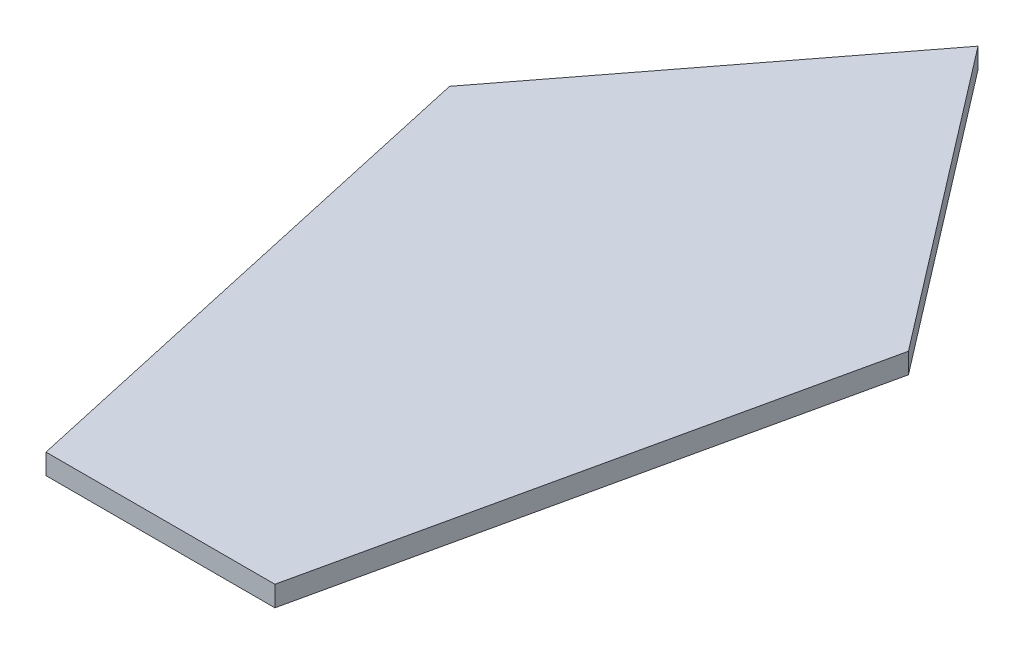
ISO-10303-21;
HEADER;
FILE_DESCRIPTION(('STEP AP214'),'2;1');
FILE_NAME('part.step','',(''),(''),'','','');
FILE_SCHEMA(('AUTOMOTIVE_DESIGN { 1 0 10303 214 1 1 1 1 }'));
ENDSEC;
DATA;
#1=APPLICATION_CONTEXT('core data for automotive mechanical design processes');
#2=APPLICATION_PROTOCOL_DEFINITION('international standard','automotive_design',2000,#1);
#3=PRODUCT_CONTEXT('',#1,'mechanical');
#4=PRODUCT('Part','Part','',(#3));
#5=PRODUCT_RELATED_PRODUCT_CATEGORY('part','',(#4));
#6=PRODUCT_DEFINITION_FORMATION('','',#4);
#7=PRODUCT_DEFINITION_CONTEXT('part definition',#1,'design');
#8=PRODUCT_DEFINITION('design','',#6,#7);
#9=PRODUCT_DEFINITION_SHAPE('','',#8);
#10=(LENGTH_UNIT() NAMED_UNIT(*) SI_UNIT(.MILLI.,.METRE.));
#11=(NAMED_UNIT(*) PLANE_ANGLE_UNIT() SI_UNIT($,.RADIAN.));
#12=(NAMED_UNIT(*) SI_UNIT($,.STERADIAN.) SOLID_ANGLE_UNIT());
#13=UNCERTAINTY_MEASURE_WITH_UNIT(LENGTH_MEASURE(1.E-05),#10,'distance_accuracy_value','');
#14=(GEOMETRIC_REPRESENTATION_CONTEXT(3) GLOBAL_UNCERTAINTY_ASSIGNED_CONTEXT((#13)) GLOBAL_UNIT_ASSIGNED_CONTEXT((#10,
#11,#12)) REPRESENTATION_CONTEXT('',''));
#15=CARTESIAN_POINT('',(0.,0.,0.));
#16=DIRECTION('',(0.,0.,1.));
#17=DIRECTION('',(1.,0.,0.));
#18=AXIS2_PLACEMENT_3D('',#15,#16,#17);
#19=CARTESIAN_POINT('',(-35.6385885351231,3.175,-80.5548871687797));
#20=DIRECTION('',(0.976296007119932,0.,-0.216439613938107));
#21=DIRECTION('',(-0.216439613938107,0.,-0.976296007119932));
#22=AXIS2_PLACEMENT_3D('',#19,#20,#21);
#23=PLANE('',#22);
#24=DIRECTION('',(0.216439613938107,0.,0.976296007119932));
#25=VECTOR('',#24,1.);
#26=CARTESIAN_POINT('',(-35.6385885351231,0.,-80.5548871687797));
#27=LINE('',#26,#25);
#28=CARTESIAN_POINT('',(-35.6385885351231,0.,-80.5548871687797));
#29=VERTEX_POINT('',#28);
#30=CARTESIAN_POINT('',(-17.78,0.,0.));
#31=VERTEX_POINT('',#30);
#32=EDGE_CURVE('E107',#29,#31,#27,.T.);
#33=ORIENTED_EDGE('',*,*,#32,.T.);
#34=DIRECTION('',(0.,-1.,0.));
#35=VECTOR('',#34,1.);
#36=CARTESIAN_POINT('',(-17.78,3.175,0.));
#37=LINE('',#36,#35);
#38=CARTESIAN_POINT('',(-17.78,3.175,0.));
#39=VERTEX_POINT('',#38);
#40=EDGE_CURVE('E11',#39,#31,#37,.T.);
#41=ORIENTED_EDGE('',*,*,#40,.F.);
#42=DIRECTION('',(0.216439613938107,0.,0.976296007119932));
#43=VECTOR('',#42,1.);
#44=CARTESIAN_POINT('',(-35.6385885351231,3.175,-80.5548871687797));
#45=LINE('',#44,#43);
#46=CARTESIAN_POINT('',(-35.6385885351231,3.175,-80.5548871687797));
#47=VERTEX_POINT('',#46);
#48=EDGE_CURVE('E115',#47,#39,#45,.T.);
#49=ORIENTED_EDGE('',*,*,#48,.F.);
#50=DIRECTION('',(0.,-1.,0.));
#51=VECTOR('',#50,1.);
#52=CARTESIAN_POINT('',(-35.6385885351231,3.175,-80.5548871687797));
#53=LINE('',#52,#51);
#54=EDGE_CURVE('E103',#47,#29,#53,.T.);
#55=ORIENTED_EDGE('',*,*,#54,.T.);
#56=EDGE_LOOP('',(#33,#41,#49,#55));
#57=FACE_BOUND('',#56,.T.);
#58=ADVANCED_FACE('F33',(#57),#23,.F.);
#59=CARTESIAN_POINT('',(-17.78,3.175,0.));
#60=DIRECTION('',(0.,0.,-1.));
#61=DIRECTION('',(-1.,0.,0.));
#62=AXIS2_PLACEMENT_3D('',#59,#60,#61);
#63=PLANE('',#62);
#64=DIRECTION('',(1.,0.,0.));
#65=VECTOR('',#64,1.);
#66=CARTESIAN_POINT('',(-17.78,0.,0.));
#67=LINE('',#66,#65);
#68=CARTESIAN_POINT('',(17.78,0.,0.));
#69=VERTEX_POINT('',#68);
#70=EDGE_CURVE('E110',#31,#69,#67,.T.);
#71=ORIENTED_EDGE('',*,*,#70,.T.);
#72=DIRECTION('',(0.,-1.,0.));
#73=VECTOR('',#72,1.);
#74=CARTESIAN_POINT('',(17.78,3.175,0.));
#75=LINE('',#74,#73);
#76=CARTESIAN_POINT('',(17.78,3.175,0.));
#77=VERTEX_POINT('',#76);
#78=EDGE_CURVE('E41',#77,#69,#75,.T.);
#79=ORIENTED_EDGE('',*,*,#78,.F.);
#80=DIRECTION('',(1.,0.,0.));
#81=VECTOR('',#80,1.);
#82=CARTESIAN_POINT('',(-17.78,3.175,0.));
#83=LINE('',#82,#81);
#84=EDGE_CURVE('E83',#39,#77,#83,.T.);
#85=ORIENTED_EDGE('',*,*,#84,.F.);
#86=ORIENTED_EDGE('',*,*,#40,.T.);
#87=EDGE_LOOP('',(#71,#79,#85,#86));
#88=FACE_BOUND('',#87,.T.);
#89=ADVANCED_FACE('F134',(#88),#63,.F.);
#90=CARTESIAN_POINT('',(17.78,3.175,0.));
#91=DIRECTION('',(-0.976296007119932,0.,-0.216439613938107));
#92=DIRECTION('',(-0.216439613938107,0.,0.976296007119932));
#93=AXIS2_PLACEMENT_3D('',#90,#91,#92);
#94=PLANE('',#93);
#95=DIRECTION('',(0.216439613938107,0.,-0.976296007119932));
#96=VECTOR('',#95,1.);
#97=CARTESIAN_POINT('',(17.78,0.,0.));
#98=LINE('',#97,#96);
#99=CARTESIAN_POINT('',(35.6385885351231,0.,-80.5548871687797));
#100=VERTEX_POINT('',#99);
#101=EDGE_CURVE('E98',#69,#100,#98,.T.);
#102=ORIENTED_EDGE('',*,*,#101,.T.);
#103=DIRECTION('',(0.,-1.,0.));
#104=VECTOR('',#103,1.);
#105=CARTESIAN_POINT('',(35.6385885351231,3.175,-80.5548871687797));
#106=LINE('',#105,#104);
#107=CARTESIAN_POINT('',(35.6385885351231,3.175,-80.5548871687797));
#108=VERTEX_POINT('',#107);
#109=EDGE_CURVE('E95',#108,#100,#106,.T.);
#110=ORIENTED_EDGE('',*,*,#109,.F.);
#111=DIRECTION('',(0.216439613938107,0.,-0.976296007119932));
#112=VECTOR('',#111,1.);
#113=CARTESIAN_POINT('',(17.78,3.175,0.));
#114=LINE('',#113,#112);
#115=EDGE_CURVE('E87',#77,#108,#114,.T.);
#116=ORIENTED_EDGE('',*,*,#115,.F.);
#117=ORIENTED_EDGE('',*,*,#78,.T.);
#118=EDGE_LOOP('',(#102,#110,#116,#117));
#119=FACE_BOUND('',#118,.T.);
#120=ADVANCED_FACE('F96',(#119),#94,.F.);
#121=CARTESIAN_POINT('',(35.6385885351231,3.175,-80.5548871687797));
#122=DIRECTION('',(-0.793353340291236,0.,0.608761429008719));
#123=DIRECTION('',(0.608761429008719,0.,0.793353340291236));
#124=AXIS2_PLACEMENT_3D('',#121,#122,#123);
#125=PLANE('',#124);
#126=DIRECTION('',(-0.608761429008719,0.,-0.793353340291236));
#127=VECTOR('',#126,1.);
#128=CARTESIAN_POINT('',(35.6385885351231,0.,-80.5548871687797));
#129=LINE('',#128,#127);
#130=CARTESIAN_POINT('',(0.,0.,-127.));
#131=VERTEX_POINT('',#130);
#132=EDGE_CURVE('E69',#100,#131,#129,.T.);
#133=ORIENTED_EDGE('',*,*,#132,.T.);
#134=DIRECTION('',(0.,-1.,0.));
#135=VECTOR('',#134,1.);
#136=CARTESIAN_POINT('',(0.,3.175,-127.));
#137=LINE('',#136,#135);
#138=CARTESIAN_POINT('',(0.,3.175,-127.));
#139=VERTEX_POINT('',#138);
#140=EDGE_CURVE('E99',#139,#131,#137,.T.);
#141=ORIENTED_EDGE('',*,*,#140,.F.);
#142=DIRECTION('',(-0.608761429008719,0.,-0.793353340291236));
#143=VECTOR('',#142,1.);
#144=CARTESIAN_POINT('',(35.6385885351231,3.175,-80.5548871687797));
#145=LINE('',#144,#143);
#146=EDGE_CURVE('E91',#108,#139,#145,.T.);
#147=ORIENTED_EDGE('',*,*,#146,.F.);
#148=ORIENTED_EDGE('',*,*,#109,.T.);
#149=EDGE_LOOP('',(#133,#141,#147,#148));
#150=FACE_BOUND('',#149,.T.);
#151=ADVANCED_FACE('F101',(#150),#125,.F.);
#152=CARTESIAN_POINT('',(0.,3.175,-127.));
#153=DIRECTION('',(0.793353340291236,0.,0.608761429008719));
#154=DIRECTION('',(0.608761429008719,0.,-0.793353340291237));
#155=AXIS2_PLACEMENT_3D('',#152,#153,#154);
#156=PLANE('',#155);
#157=DIRECTION('',(-0.608761429008719,0.,0.793353340291236));
#158=VECTOR('',#157,1.);
#159=CARTESIAN_POINT('',(0.,0.,-127.));
#160=LINE('',#159,#158);
#161=EDGE_CURVE('E75',#131,#29,#160,.T.);
#162=ORIENTED_EDGE('',*,*,#161,.T.);
#163=ORIENTED_EDGE('',*,*,#54,.F.);
#164=DIRECTION('',(-0.608761429008719,0.,0.793353340291236));
#165=VECTOR('',#164,1.);
#166=CARTESIAN_POINT('',(0.,3.175,-127.));
#167=LINE('',#166,#165);
#168=EDGE_CURVE('E49',#139,#47,#167,.T.);
#169=ORIENTED_EDGE('',*,*,#168,.F.);
#170=ORIENTED_EDGE('',*,*,#140,.T.);
#171=EDGE_LOOP('',(#162,#163,#169,#170));
#172=FACE_BOUND('',#171,.T.);
#173=ADVANCED_FACE('F123',(#172),#156,.F.);
#174=CARTESIAN_POINT('',(0.,3.175,0.));
#175=DIRECTION('',(0.,1.,0.));
#176=DIRECTION('',(0.,0.,1.));
#177=AXIS2_PLACEMENT_3D('',#174,#175,#176);
#178=PLANE('',#177);
#179=ORIENTED_EDGE('',*,*,#48,.T.);
#180=ORIENTED_EDGE('',*,*,#84,.T.);
#181=ORIENTED_EDGE('',*,*,#115,.T.);
#182=ORIENTED_EDGE('',*,*,#146,.T.);
#183=ORIENTED_EDGE('',*,*,#168,.T.);
#184=EDGE_LOOP('',(#179,#180,#181,#182,#183));
#185=FACE_BOUND('',#184,.T.);
#186=ADVANCED_FACE('F89',(#185),#178,.T.);
#187=CARTESIAN_POINT('',(0.,0.,0.));
#188=DIRECTION('',(0.,1.,0.));
#189=DIRECTION('',(0.,0.,1.));
#190=AXIS2_PLACEMENT_3D('',#187,#188,#189);
#191=PLANE('',#190);
#192=ORIENTED_EDGE('',*,*,#32,.F.);
#193=ORIENTED_EDGE('',*,*,#161,.F.);
#194=ORIENTED_EDGE('',*,*,#132,.F.);
#195=ORIENTED_EDGE('',*,*,#101,.F.);
#196=ORIENTED_EDGE('',*,*,#70,.F.);
#197=EDGE_LOOP('',(#192,#193,#194,#195,#196));
#198=FACE_BOUND('',#197,.T.);
#199=ADVANCED_FACE('F119',(#198),#191,.F.);
#200=CLOSED_SHELL('',(#58,#89,#120,#151,#173,#186,#199));
#201=MANIFOLD_SOLID_BREP('B2',#200);
#202=ADVANCED_BREP_SHAPE_REPRESENTATION('',(#18,#201),#14);
#203=SHAPE_DEFINITION_REPRESENTATION(#9,#202);
ENDSEC;
END-ISO-10303-21;
